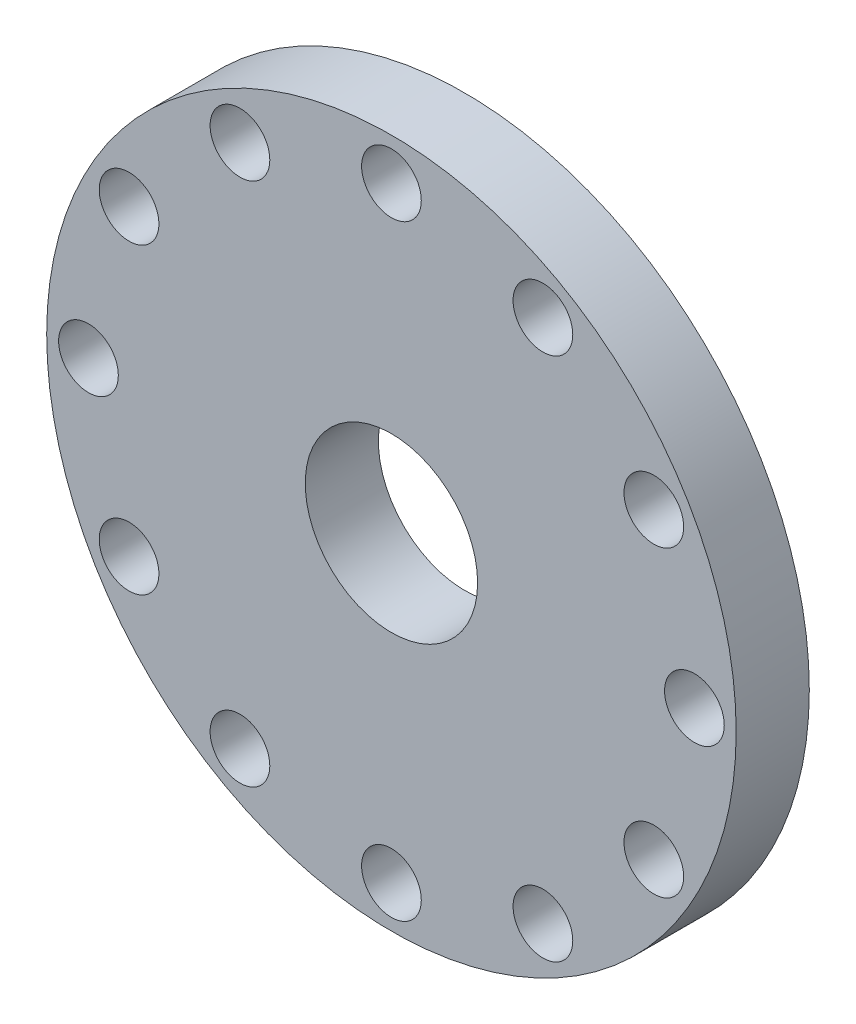
ISO-10303-21;
HEADER;
FILE_DESCRIPTION(('STEP AP214'),'2;1');
FILE_NAME('part.step','',(''),(''),'','','');
FILE_SCHEMA(('AUTOMOTIVE_DESIGN { 1 0 10303 214 1 1 1 1 }'));
ENDSEC;
DATA;
#1=APPLICATION_CONTEXT('core data for automotive mechanical design processes');
#2=APPLICATION_PROTOCOL_DEFINITION('international standard','automotive_design',2000,#1);
#3=PRODUCT_CONTEXT('',#1,'mechanical');
#4=PRODUCT('Part','Part','',(#3));
#5=PRODUCT_RELATED_PRODUCT_CATEGORY('part','',(#4));
#6=PRODUCT_DEFINITION_FORMATION('','',#4);
#7=PRODUCT_DEFINITION_CONTEXT('part definition',#1,'design');
#8=PRODUCT_DEFINITION('design','',#6,#7);
#9=PRODUCT_DEFINITION_SHAPE('','',#8);
#10=(LENGTH_UNIT() NAMED_UNIT(*) SI_UNIT(.MILLI.,.METRE.));
#11=(NAMED_UNIT(*) PLANE_ANGLE_UNIT() SI_UNIT($,.RADIAN.));
#12=(NAMED_UNIT(*) SI_UNIT($,.STERADIAN.) SOLID_ANGLE_UNIT());
#13=UNCERTAINTY_MEASURE_WITH_UNIT(LENGTH_MEASURE(1.E-05),#10,'distance_accuracy_value','');
#14=(GEOMETRIC_REPRESENTATION_CONTEXT(3) GLOBAL_UNCERTAINTY_ASSIGNED_CONTEXT((#13)) GLOBAL_UNIT_ASSIGNED_CONTEXT((#10,
#11,#12)) REPRESENTATION_CONTEXT('',''));
#15=CARTESIAN_POINT('',(0.,0.,0.));
#16=DIRECTION('',(0.,0.,1.));
#17=DIRECTION('',(1.,0.,0.));
#18=AXIS2_PLACEMENT_3D('',#15,#16,#17);
#19=CARTESIAN_POINT('',(0.,0.,70.));
#20=DIRECTION('',(0.,0.,1.));
#21=DIRECTION('',(1.,0.,0.));
#22=AXIS2_PLACEMENT_3D('',#19,#20,#21);
#23=PLANE('',#22);
#24=CARTESIAN_POINT('',(251.147367097493,145.000000000011,70.));
#25=DIRECTION('',(0.,0.,1.));
#26=DIRECTION('',(1.,0.,0.));
#27=AXIS2_PLACEMENT_3D('',#24,#25,#26);
#28=CIRCLE('',#27,28.5750000000034);
#29=CARTESIAN_POINT('',(279.722367097497,145.000000000011,70.));
#30=VERTEX_POINT('',#29);
#31=EDGE_CURVE('E64',#30,#30,#28,.F.);
#32=ORIENTED_EDGE('',*,*,#31,.T.);
#33=EDGE_LOOP('',(#32));
#34=FACE_BOUND('',#33,.T.);
#35=CARTESIAN_POINT('',(145.,251.147367097487,70.));
#36=DIRECTION('',(0.,0.,1.));
#37=DIRECTION('',(1.,0.,0.));
#38=AXIS2_PLACEMENT_3D('',#35,#36,#37);
#39=CIRCLE('',#38,28.575);
#40=CARTESIAN_POINT('',(173.575,251.147367097487,70.));
#41=VERTEX_POINT('',#40);
#42=EDGE_CURVE('E67',#41,#41,#39,.F.);
#43=ORIENTED_EDGE('',*,*,#42,.T.);
#44=EDGE_LOOP('',(#43));
#45=FACE_BOUND('',#44,.T.);
#46=CARTESIAN_POINT('',(0.,290.,70.));
#47=DIRECTION('',(0.,0.,1.));
#48=DIRECTION('',(1.,0.,0.));
#49=AXIS2_PLACEMENT_3D('',#46,#47,#48);
#50=CIRCLE('',#49,28.575);
#51=CARTESIAN_POINT('',(28.575,290.,70.));
#52=VERTEX_POINT('',#51);
#53=EDGE_CURVE('E70',#52,#52,#50,.F.);
#54=ORIENTED_EDGE('',*,*,#53,.T.);
#55=EDGE_LOOP('',(#54));
#56=FACE_BOUND('',#55,.T.);
#57=CARTESIAN_POINT('',(-144.999999999998,251.147367097481,70.));
#58=DIRECTION('',(0.,0.,1.));
#59=DIRECTION('',(1.,0.,0.));
#60=AXIS2_PLACEMENT_3D('',#57,#58,#59);
#61=CIRCLE('',#60,28.5750000000072);
#62=CARTESIAN_POINT('',(-116.424999999991,251.147367097481,70.));
#63=VERTEX_POINT('',#62);
#64=EDGE_CURVE('E73',#63,#63,#61,.F.);
#65=ORIENTED_EDGE('',*,*,#64,.T.);
#66=EDGE_LOOP('',(#65));
#67=FACE_BOUND('',#66,.T.);
#68=CARTESIAN_POINT('',(-251.147367097481,144.999999999989,70.));
#69=DIRECTION('',(0.,0.,1.));
#70=DIRECTION('',(1.,0.,0.));
#71=AXIS2_PLACEMENT_3D('',#68,#69,#70);
#72=CIRCLE('',#71,28.5750000000125);
#73=CARTESIAN_POINT('',(-222.572367097469,144.999999999989,70.));
#74=VERTEX_POINT('',#73);
#75=EDGE_CURVE('E76',#74,#74,#72,.F.);
#76=ORIENTED_EDGE('',*,*,#75,.T.);
#77=EDGE_LOOP('',(#76));
#78=FACE_BOUND('',#77,.T.);
#79=CARTESIAN_POINT('',(145.000000000023,-251.147367097481,70.));
#80=DIRECTION('',(0.,0.,1.));
#81=DIRECTION('',(1.,0.,0.));
#82=AXIS2_PLACEMENT_3D('',#79,#80,#81);
#83=CIRCLE('',#82,28.5750000000219);
#84=CARTESIAN_POINT('',(173.575000000045,-251.147367097481,70.));
#85=VERTEX_POINT('',#84);
#86=EDGE_CURVE('E79',#85,#85,#83,.F.);
#87=ORIENTED_EDGE('',*,*,#86,.T.);
#88=EDGE_LOOP('',(#87));
#89=FACE_BOUND('',#88,.T.);
#90=CARTESIAN_POINT('',(-144.999999999977,-251.147367097493,70.));
#91=DIRECTION('',(0.,0.,1.));
#92=DIRECTION('',(1.,0.,0.));
#93=AXIS2_PLACEMENT_3D('',#90,#91,#92);
#94=CIRCLE('',#93,28.5750000000261);
#95=CARTESIAN_POINT('',(-116.424999999951,-251.147367097493,70.));
#96=VERTEX_POINT('',#95);
#97=EDGE_CURVE('E82',#96,#96,#94,.F.);
#98=ORIENTED_EDGE('',*,*,#97,.T.);
#99=EDGE_LOOP('',(#98));
#100=FACE_BOUND('',#99,.T.);
#101=CARTESIAN_POINT('',(251.147367097506,-144.999999999989,70.));
#102=DIRECTION('',(0.,0.,1.));
#103=DIRECTION('',(1.,0.,0.));
#104=AXIS2_PLACEMENT_3D('',#101,#102,#103);
#105=CIRCLE('',#104,28.5750000000159);
#106=CARTESIAN_POINT('',(279.722367097522,-144.999999999989,70.));
#107=VERTEX_POINT('',#106);
#108=EDGE_CURVE('E85',#107,#107,#105,.F.);
#109=ORIENTED_EDGE('',*,*,#108,.T.);
#110=EDGE_LOOP('',(#109));
#111=FACE_BOUND('',#110,.T.);
#112=CARTESIAN_POINT('',(2.46558576901009E-11,-290.,70.));
#113=DIRECTION('',(0.,0.,1.));
#114=DIRECTION('',(1.,0.,0.));
#115=AXIS2_PLACEMENT_3D('',#112,#113,#114);
#116=CIRCLE('',#115,28.5750000000255);
#117=CARTESIAN_POINT('',(28.5750000000502,-290.,70.));
#118=VERTEX_POINT('',#117);
#119=EDGE_CURVE('E88',#118,#118,#116,.F.);
#120=ORIENTED_EDGE('',*,*,#119,.T.);
#121=EDGE_LOOP('',(#120));
#122=FACE_BOUND('',#121,.T.);
#123=CARTESIAN_POINT('',(-251.147367097469,-145.000000000011,70.));
#124=DIRECTION('',(0.,0.,1.));
#125=DIRECTION('',(1.,0.,0.));
#126=AXIS2_PLACEMENT_3D('',#123,#124,#125);
#127=CIRCLE('',#126,28.5750000000236);
#128=CARTESIAN_POINT('',(-222.572367097445,-145.000000000011,70.));
#129=VERTEX_POINT('',#128);
#130=EDGE_CURVE('E91',#129,#129,#127,.F.);
#131=ORIENTED_EDGE('',*,*,#130,.T.);
#132=EDGE_LOOP('',(#131));
#133=FACE_BOUND('',#132,.T.);
#134=CARTESIAN_POINT('',(-289.999999999988,-1.23634436022257E-11,70.));
#135=DIRECTION('',(0.,0.,1.));
#136=DIRECTION('',(1.,0.,0.));
#137=AXIS2_PLACEMENT_3D('',#134,#135,#136);
#138=CIRCLE('',#137,28.5750000000184);
#139=CARTESIAN_POINT('',(-261.424999999969,-1.23634436022257E-11,70.));
#140=VERTEX_POINT('',#139);
#141=EDGE_CURVE('E94',#140,#140,#138,.F.);
#142=ORIENTED_EDGE('',*,*,#141,.T.);
#143=EDGE_LOOP('',(#142));
#144=FACE_BOUND('',#143,.T.);
#145=CARTESIAN_POINT('',(290.000000000012,1.23279288450505E-11,70.));
#146=DIRECTION('',(0.,0.,1.));
#147=DIRECTION('',(1.,0.,0.));
#148=AXIS2_PLACEMENT_3D('',#145,#146,#147);
#149=CIRCLE('',#148,28.5750000000092);
#150=CARTESIAN_POINT('',(318.575000000021,1.23279288450505E-11,70.));
#151=VERTEX_POINT('',#150);
#152=EDGE_CURVE('E56',#151,#151,#149,.F.);
#153=ORIENTED_EDGE('',*,*,#152,.T.);
#154=EDGE_LOOP('',(#153));
#155=FACE_BOUND('',#154,.T.);
#156=CARTESIAN_POINT('',(0.,0.,70.));
#157=DIRECTION('',(0.,0.,1.));
#158=DIRECTION('',(1.,0.,0.));
#159=AXIS2_PLACEMENT_3D('',#156,#157,#158);
#160=CIRCLE('',#159,330.);
#161=CARTESIAN_POINT('',(330.,0.,70.));
#162=VERTEX_POINT('',#161);
#163=EDGE_CURVE('E11',#162,#162,#160,.T.);
#164=ORIENTED_EDGE('',*,*,#163,.T.);
#165=EDGE_LOOP('',(#164));
#166=FACE_BOUND('',#165,.T.);
#167=CARTESIAN_POINT('',(0.,0.,70.));
#168=DIRECTION('',(0.,0.,1.));
#169=DIRECTION('',(1.,0.,0.));
#170=AXIS2_PLACEMENT_3D('',#167,#168,#169);
#171=CIRCLE('',#170,82.5);
#172=CARTESIAN_POINT('',(82.5,0.,70.));
#173=VERTEX_POINT('',#172);
#174=EDGE_CURVE('E51',#173,#173,#171,.T.);
#175=ORIENTED_EDGE('',*,*,#174,.F.);
#176=EDGE_LOOP('',(#175));
#177=FACE_BOUND('',#176,.T.);
#178=ADVANCED_FACE('F40',(#34,#45,#56,#67,#78,#89,#100,#111,#122,#133,#144,#155,#166,#177),#23,.T.);
#179=CARTESIAN_POINT('',(0.,0.,0.));
#180=DIRECTION('',(0.,0.,1.));
#181=DIRECTION('',(1.,0.,0.));
#182=AXIS2_PLACEMENT_3D('',#179,#180,#181);
#183=PLANE('',#182);
#184=CARTESIAN_POINT('',(251.147367097493,145.000000000011,0.));
#185=DIRECTION('',(0.,0.,1.));
#186=DIRECTION('',(1.,0.,0.));
#187=AXIS2_PLACEMENT_3D('',#184,#185,#186);
#188=CIRCLE('',#187,28.5750000000034);
#189=CARTESIAN_POINT('',(279.722367097497,145.000000000011,0.));
#190=VERTEX_POINT('',#189);
#191=EDGE_CURVE('E97',#190,#190,#188,.T.);
#192=ORIENTED_EDGE('',*,*,#191,.T.);
#193=EDGE_LOOP('',(#192));
#194=FACE_BOUND('',#193,.T.);
#195=CARTESIAN_POINT('',(145.,251.147367097487,0.));
#196=DIRECTION('',(0.,0.,1.));
#197=DIRECTION('',(1.,0.,0.));
#198=AXIS2_PLACEMENT_3D('',#195,#196,#197);
#199=CIRCLE('',#198,28.575);
#200=CARTESIAN_POINT('',(173.575,251.147367097487,0.));
#201=VERTEX_POINT('',#200);
#202=EDGE_CURVE('E125',#201,#201,#199,.T.);
#203=ORIENTED_EDGE('',*,*,#202,.T.);
#204=EDGE_LOOP('',(#203));
#205=FACE_BOUND('',#204,.T.);
#206=CARTESIAN_POINT('',(0.,290.,0.));
#207=DIRECTION('',(0.,0.,1.));
#208=DIRECTION('',(1.,0.,0.));
#209=AXIS2_PLACEMENT_3D('',#206,#207,#208);
#210=CIRCLE('',#209,28.575);
#211=CARTESIAN_POINT('',(28.575,290.,0.));
#212=VERTEX_POINT('',#211);
#213=EDGE_CURVE('E122',#212,#212,#210,.T.);
#214=ORIENTED_EDGE('',*,*,#213,.T.);
#215=EDGE_LOOP('',(#214));
#216=FACE_BOUND('',#215,.T.);
#217=CARTESIAN_POINT('',(-144.999999999998,251.147367097481,0.));
#218=DIRECTION('',(0.,0.,1.));
#219=DIRECTION('',(1.,0.,0.));
#220=AXIS2_PLACEMENT_3D('',#217,#218,#219);
#221=CIRCLE('',#220,28.5750000000072);
#222=CARTESIAN_POINT('',(-116.424999999991,251.147367097481,0.));
#223=VERTEX_POINT('',#222);
#224=EDGE_CURVE('E119',#223,#223,#221,.T.);
#225=ORIENTED_EDGE('',*,*,#224,.T.);
#226=EDGE_LOOP('',(#225));
#227=FACE_BOUND('',#226,.T.);
#228=CARTESIAN_POINT('',(-251.147367097481,144.999999999989,0.));
#229=DIRECTION('',(0.,0.,1.));
#230=DIRECTION('',(1.,0.,0.));
#231=AXIS2_PLACEMENT_3D('',#228,#229,#230);
#232=CIRCLE('',#231,28.5750000000125);
#233=CARTESIAN_POINT('',(-222.572367097469,144.999999999989,0.));
#234=VERTEX_POINT('',#233);
#235=EDGE_CURVE('E108',#234,#234,#232,.T.);
#236=ORIENTED_EDGE('',*,*,#235,.T.);
#237=EDGE_LOOP('',(#236));
#238=FACE_BOUND('',#237,.T.);
#239=CARTESIAN_POINT('',(145.000000000023,-251.147367097481,0.));
#240=DIRECTION('',(0.,0.,1.));
#241=DIRECTION('',(1.,0.,0.));
#242=AXIS2_PLACEMENT_3D('',#239,#240,#241);
#243=CIRCLE('',#242,28.5750000000219);
#244=CARTESIAN_POINT('',(173.575000000045,-251.147367097481,0.));
#245=VERTEX_POINT('',#244);
#246=EDGE_CURVE('E109',#245,#245,#243,.T.);
#247=ORIENTED_EDGE('',*,*,#246,.T.);
#248=EDGE_LOOP('',(#247));
#249=FACE_BOUND('',#248,.T.);
#250=CARTESIAN_POINT('',(-144.999999999977,-251.147367097493,0.));
#251=DIRECTION('',(0.,0.,1.));
#252=DIRECTION('',(1.,0.,0.));
#253=AXIS2_PLACEMENT_3D('',#250,#251,#252);
#254=CIRCLE('',#253,28.5750000000261);
#255=CARTESIAN_POINT('',(-116.424999999951,-251.147367097493,0.));
#256=VERTEX_POINT('',#255);
#257=EDGE_CURVE('E112',#256,#256,#254,.T.);
#258=ORIENTED_EDGE('',*,*,#257,.T.);
#259=EDGE_LOOP('',(#258));
#260=FACE_BOUND('',#259,.T.);
#261=CARTESIAN_POINT('',(251.147367097506,-144.999999999989,0.));
#262=DIRECTION('',(0.,0.,1.));
#263=DIRECTION('',(1.,0.,0.));
#264=AXIS2_PLACEMENT_3D('',#261,#262,#263);
#265=CIRCLE('',#264,28.5750000000159);
#266=CARTESIAN_POINT('',(279.722367097522,-144.999999999989,0.));
#267=VERTEX_POINT('',#266);
#268=EDGE_CURVE('E102',#267,#267,#265,.T.);
#269=ORIENTED_EDGE('',*,*,#268,.T.);
#270=EDGE_LOOP('',(#269));
#271=FACE_BOUND('',#270,.T.);
#272=CARTESIAN_POINT('',(2.46558576901009E-11,-290.,0.));
#273=DIRECTION('',(0.,0.,1.));
#274=DIRECTION('',(1.,0.,0.));
#275=AXIS2_PLACEMENT_3D('',#272,#273,#274);
#276=CIRCLE('',#275,28.5750000000255);
#277=CARTESIAN_POINT('',(28.5750000000502,-290.,0.));
#278=VERTEX_POINT('',#277);
#279=EDGE_CURVE('E98',#278,#278,#276,.T.);
#280=ORIENTED_EDGE('',*,*,#279,.T.);
#281=EDGE_LOOP('',(#280));
#282=FACE_BOUND('',#281,.T.);
#283=CARTESIAN_POINT('',(-251.147367097469,-145.000000000011,0.));
#284=DIRECTION('',(0.,0.,1.));
#285=DIRECTION('',(1.,0.,0.));
#286=AXIS2_PLACEMENT_3D('',#283,#284,#285);
#287=CIRCLE('',#286,28.5750000000236);
#288=CARTESIAN_POINT('',(-222.572367097445,-145.000000000011,0.));
#289=VERTEX_POINT('',#288);
#290=EDGE_CURVE('E101',#289,#289,#287,.T.);
#291=ORIENTED_EDGE('',*,*,#290,.T.);
#292=EDGE_LOOP('',(#291));
#293=FACE_BOUND('',#292,.T.);
#294=CARTESIAN_POINT('',(-289.999999999988,-1.23634436022257E-11,0.));
#295=DIRECTION('',(0.,0.,1.));
#296=DIRECTION('',(1.,0.,0.));
#297=AXIS2_PLACEMENT_3D('',#294,#295,#296);
#298=CIRCLE('',#297,28.5750000000184);
#299=CARTESIAN_POINT('',(-261.424999999969,-1.23634436022257E-11,0.));
#300=VERTEX_POINT('',#299);
#301=EDGE_CURVE('E105',#300,#300,#298,.T.);
#302=ORIENTED_EDGE('',*,*,#301,.T.);
#303=EDGE_LOOP('',(#302));
#304=FACE_BOUND('',#303,.T.);
#305=CARTESIAN_POINT('',(290.000000000012,1.23279288450505E-11,0.));
#306=DIRECTION('',(0.,0.,1.));
#307=DIRECTION('',(1.,0.,0.));
#308=AXIS2_PLACEMENT_3D('',#305,#306,#307);
#309=CIRCLE('',#308,28.5750000000092);
#310=CARTESIAN_POINT('',(318.575000000021,1.23279288450505E-11,0.));
#311=VERTEX_POINT('',#310);
#312=EDGE_CURVE('E61',#311,#311,#309,.T.);
#313=ORIENTED_EDGE('',*,*,#312,.T.);
#314=EDGE_LOOP('',(#313));
#315=FACE_BOUND('',#314,.T.);
#316=CARTESIAN_POINT('',(0.,0.,0.));
#317=DIRECTION('',(0.,0.,1.));
#318=DIRECTION('',(1.,0.,0.));
#319=AXIS2_PLACEMENT_3D('',#316,#317,#318);
#320=CIRCLE('',#319,330.);
#321=CARTESIAN_POINT('',(330.,0.,0.));
#322=VERTEX_POINT('',#321);
#323=EDGE_CURVE('E44',#322,#322,#320,.T.);
#324=ORIENTED_EDGE('',*,*,#323,.F.);
#325=EDGE_LOOP('',(#324));
#326=FACE_BOUND('',#325,.T.);
#327=CARTESIAN_POINT('',(0.,0.,0.));
#328=DIRECTION('',(0.,0.,1.));
#329=DIRECTION('',(1.,0.,0.));
#330=AXIS2_PLACEMENT_3D('',#327,#328,#329);
#331=CIRCLE('',#330,82.5);
#332=CARTESIAN_POINT('',(82.5,0.,0.));
#333=VERTEX_POINT('',#332);
#334=EDGE_CURVE('E53',#333,#333,#331,.T.);
#335=ORIENTED_EDGE('',*,*,#334,.T.);
#336=EDGE_LOOP('',(#335));
#337=FACE_BOUND('',#336,.T.);
#338=ADVANCED_FACE('F131',(#194,#205,#216,#227,#238,#249,#260,#271,#282,#293,#304,#315,#326,
#337),#183,.F.);
#339=CARTESIAN_POINT('',(0.,0.,70.));
#340=DIRECTION('',(0.,0.,-1.));
#341=DIRECTION('',(-1.,0.,0.));
#342=AXIS2_PLACEMENT_3D('',#339,#340,#341);
#343=CYLINDRICAL_SURFACE('',#342,330.);
#344=ORIENTED_EDGE('',*,*,#163,.F.);
#345=EDGE_LOOP('',(#344));
#346=FACE_BOUND('',#345,.T.);
#347=ORIENTED_EDGE('',*,*,#323,.T.);
#348=EDGE_LOOP('',(#347));
#349=FACE_BOUND('',#348,.T.);
#350=ADVANCED_FACE('F42',(#346,#349),#343,.T.);
#351=CARTESIAN_POINT('',(0.,0.,70.));
#352=DIRECTION('',(0.,0.,-1.));
#353=DIRECTION('',(-1.,0.,0.));
#354=AXIS2_PLACEMENT_3D('',#351,#352,#353);
#355=CYLINDRICAL_SURFACE('',#354,82.5);
#356=ORIENTED_EDGE('',*,*,#174,.T.);
#357=EDGE_LOOP('',(#356));
#358=FACE_BOUND('',#357,.T.);
#359=ORIENTED_EDGE('',*,*,#334,.F.);
#360=EDGE_LOOP('',(#359));
#361=FACE_BOUND('',#360,.T.);
#362=ADVANCED_FACE('F154',(#358,#361),#355,.F.);
#363=CARTESIAN_POINT('',(290.000000000012,1.23279288450505E-11,131.));
#364=DIRECTION('',(0.,0.,-1.));
#365=DIRECTION('',(-1.,0.,0.));
#366=AXIS2_PLACEMENT_3D('',#363,#364,#365);
#367=CYLINDRICAL_SURFACE('',#366,28.5750000000092);
#368=ORIENTED_EDGE('',*,*,#152,.F.);
#369=EDGE_LOOP('',(#368));
#370=FACE_BOUND('',#369,.T.);
#371=ORIENTED_EDGE('',*,*,#312,.F.);
#372=EDGE_LOOP('',(#371));
#373=FACE_BOUND('',#372,.T.);
#374=ADVANCED_FACE('F157',(#370,#373),#367,.F.);
#375=CARTESIAN_POINT('',(-289.999999999988,-1.23634436022257E-11,131.));
#376=DIRECTION('',(0.,0.,-1.));
#377=DIRECTION('',(-1.,0.,0.));
#378=AXIS2_PLACEMENT_3D('',#375,#376,#377);
#379=CYLINDRICAL_SURFACE('',#378,28.5750000000184);
#380=ORIENTED_EDGE('',*,*,#141,.F.);
#381=EDGE_LOOP('',(#380));
#382=FACE_BOUND('',#381,.T.);
#383=ORIENTED_EDGE('',*,*,#301,.F.);
#384=EDGE_LOOP('',(#383));
#385=FACE_BOUND('',#384,.T.);
#386=ADVANCED_FACE('F161',(#382,#385),#379,.F.);
#387=CARTESIAN_POINT('',(-251.147367097469,-145.000000000011,131.));
#388=DIRECTION('',(0.,0.,-1.));
#389=DIRECTION('',(-1.,0.,0.));
#390=AXIS2_PLACEMENT_3D('',#387,#388,#389);
#391=CYLINDRICAL_SURFACE('',#390,28.5750000000236);
#392=ORIENTED_EDGE('',*,*,#130,.F.);
#393=EDGE_LOOP('',(#392));
#394=FACE_BOUND('',#393,.T.);
#395=ORIENTED_EDGE('',*,*,#290,.F.);
#396=EDGE_LOOP('',(#395));
#397=FACE_BOUND('',#396,.T.);
#398=ADVANCED_FACE('F167',(#394,#397),#391,.F.);
#399=CARTESIAN_POINT('',(2.46558576901009E-11,-290.,131.));
#400=DIRECTION('',(0.,0.,-1.));
#401=DIRECTION('',(-1.,0.,0.));
#402=AXIS2_PLACEMENT_3D('',#399,#400,#401);
#403=CYLINDRICAL_SURFACE('',#402,28.5750000000255);
#404=ORIENTED_EDGE('',*,*,#119,.F.);
#405=EDGE_LOOP('',(#404));
#406=FACE_BOUND('',#405,.T.);
#407=ORIENTED_EDGE('',*,*,#279,.F.);
#408=EDGE_LOOP('',(#407));
#409=FACE_BOUND('',#408,.T.);
#410=ADVANCED_FACE('F163',(#406,#409),#403,.F.);
#411=CARTESIAN_POINT('',(251.147367097506,-144.999999999989,131.));
#412=DIRECTION('',(0.,0.,-1.));
#413=DIRECTION('',(-1.,0.,0.));
#414=AXIS2_PLACEMENT_3D('',#411,#412,#413);
#415=CYLINDRICAL_SURFACE('',#414,28.5750000000159);
#416=ORIENTED_EDGE('',*,*,#108,.F.);
#417=EDGE_LOOP('',(#416));
#418=FACE_BOUND('',#417,.T.);
#419=ORIENTED_EDGE('',*,*,#268,.F.);
#420=EDGE_LOOP('',(#419));
#421=FACE_BOUND('',#420,.T.);
#422=ADVANCED_FACE('F166',(#418,#421),#415,.F.);
#423=CARTESIAN_POINT('',(-144.999999999977,-251.147367097493,131.));
#424=DIRECTION('',(0.,0.,-1.));
#425=DIRECTION('',(-1.,0.,0.));
#426=AXIS2_PLACEMENT_3D('',#423,#424,#425);
#427=CYLINDRICAL_SURFACE('',#426,28.5750000000261);
#428=ORIENTED_EDGE('',*,*,#97,.F.);
#429=EDGE_LOOP('',(#428));
#430=FACE_BOUND('',#429,.T.);
#431=ORIENTED_EDGE('',*,*,#257,.F.);
#432=EDGE_LOOP('',(#431));
#433=FACE_BOUND('',#432,.T.);
#434=ADVANCED_FACE('F179',(#430,#433),#427,.F.);
#435=CARTESIAN_POINT('',(145.000000000023,-251.147367097481,131.));
#436=DIRECTION('',(0.,0.,-1.));
#437=DIRECTION('',(-1.,0.,0.));
#438=AXIS2_PLACEMENT_3D('',#435,#436,#437);
#439=CYLINDRICAL_SURFACE('',#438,28.5750000000219);
#440=ORIENTED_EDGE('',*,*,#86,.F.);
#441=EDGE_LOOP('',(#440));
#442=FACE_BOUND('',#441,.T.);
#443=ORIENTED_EDGE('',*,*,#246,.F.);
#444=EDGE_LOOP('',(#443));
#445=FACE_BOUND('',#444,.T.);
#446=ADVANCED_FACE('F175',(#442,#445),#439,.F.);
#447=CARTESIAN_POINT('',(-251.147367097481,144.999999999989,131.));
#448=DIRECTION('',(0.,0.,-1.));
#449=DIRECTION('',(-1.,0.,0.));
#450=AXIS2_PLACEMENT_3D('',#447,#448,#449);
#451=CYLINDRICAL_SURFACE('',#450,28.5750000000125);
#452=ORIENTED_EDGE('',*,*,#75,.F.);
#453=EDGE_LOOP('',(#452));
#454=FACE_BOUND('',#453,.T.);
#455=ORIENTED_EDGE('',*,*,#235,.F.);
#456=EDGE_LOOP('',(#455));
#457=FACE_BOUND('',#456,.T.);
#458=ADVANCED_FACE('F178',(#454,#457),#451,.F.);
#459=CARTESIAN_POINT('',(-144.999999999998,251.147367097481,131.));
#460=DIRECTION('',(0.,0.,-1.));
#461=DIRECTION('',(-1.,0.,0.));
#462=AXIS2_PLACEMENT_3D('',#459,#460,#461);
#463=CYLINDRICAL_SURFACE('',#462,28.5750000000072);
#464=ORIENTED_EDGE('',*,*,#64,.F.);
#465=EDGE_LOOP('',(#464));
#466=FACE_BOUND('',#465,.T.);
#467=ORIENTED_EDGE('',*,*,#224,.F.);
#468=EDGE_LOOP('',(#467));
#469=FACE_BOUND('',#468,.T.);
#470=ADVANCED_FACE('F189',(#466,#469),#463,.F.);
#471=CARTESIAN_POINT('',(0.,290.,131.));
#472=DIRECTION('',(0.,0.,-1.));
#473=DIRECTION('',(-1.,0.,0.));
#474=AXIS2_PLACEMENT_3D('',#471,#472,#473);
#475=CYLINDRICAL_SURFACE('',#474,28.575);
#476=ORIENTED_EDGE('',*,*,#53,.F.);
#477=EDGE_LOOP('',(#476));
#478=FACE_BOUND('',#477,.T.);
#479=ORIENTED_EDGE('',*,*,#213,.F.);
#480=EDGE_LOOP('',(#479));
#481=FACE_BOUND('',#480,.T.);
#482=ADVANCED_FACE('F142',(#478,#481),#475,.F.);
#483=CARTESIAN_POINT('',(145.,251.147367097487,131.));
#484=DIRECTION('',(0.,0.,-1.));
#485=DIRECTION('',(-1.,0.,0.));
#486=AXIS2_PLACEMENT_3D('',#483,#484,#485);
#487=CYLINDRICAL_SURFACE('',#486,28.575);
#488=ORIENTED_EDGE('',*,*,#42,.F.);
#489=EDGE_LOOP('',(#488));
#490=FACE_BOUND('',#489,.T.);
#491=ORIENTED_EDGE('',*,*,#202,.F.);
#492=EDGE_LOOP('',(#491));
#493=FACE_BOUND('',#492,.T.);
#494=ADVANCED_FACE('F136',(#490,#493),#487,.F.);
#495=CARTESIAN_POINT('',(251.147367097493,145.000000000011,131.));
#496=DIRECTION('',(0.,0.,-1.));
#497=DIRECTION('',(-1.,0.,0.));
#498=AXIS2_PLACEMENT_3D('',#495,#496,#497);
#499=CYLINDRICAL_SURFACE('',#498,28.5750000000034);
#500=ORIENTED_EDGE('',*,*,#31,.F.);
#501=EDGE_LOOP('',(#500));
#502=FACE_BOUND('',#501,.T.);
#503=ORIENTED_EDGE('',*,*,#191,.F.);
#504=EDGE_LOOP('',(#503));
#505=FACE_BOUND('',#504,.T.);
#506=ADVANCED_FACE('F134',(#502,#505),#499,.F.);
#507=CLOSED_SHELL('',(#178,#338,#350,#362,#374,#386,#398,#410,#422,#434,#446,#458,#470,#482,
#494,#506));
#508=MANIFOLD_SOLID_BREP('B2',#507);
#509=ADVANCED_BREP_SHAPE_REPRESENTATION('',(#18,#508),#14);
#510=SHAPE_DEFINITION_REPRESENTATION(#9,#509);
ENDSEC;
END-ISO-10303-21;
